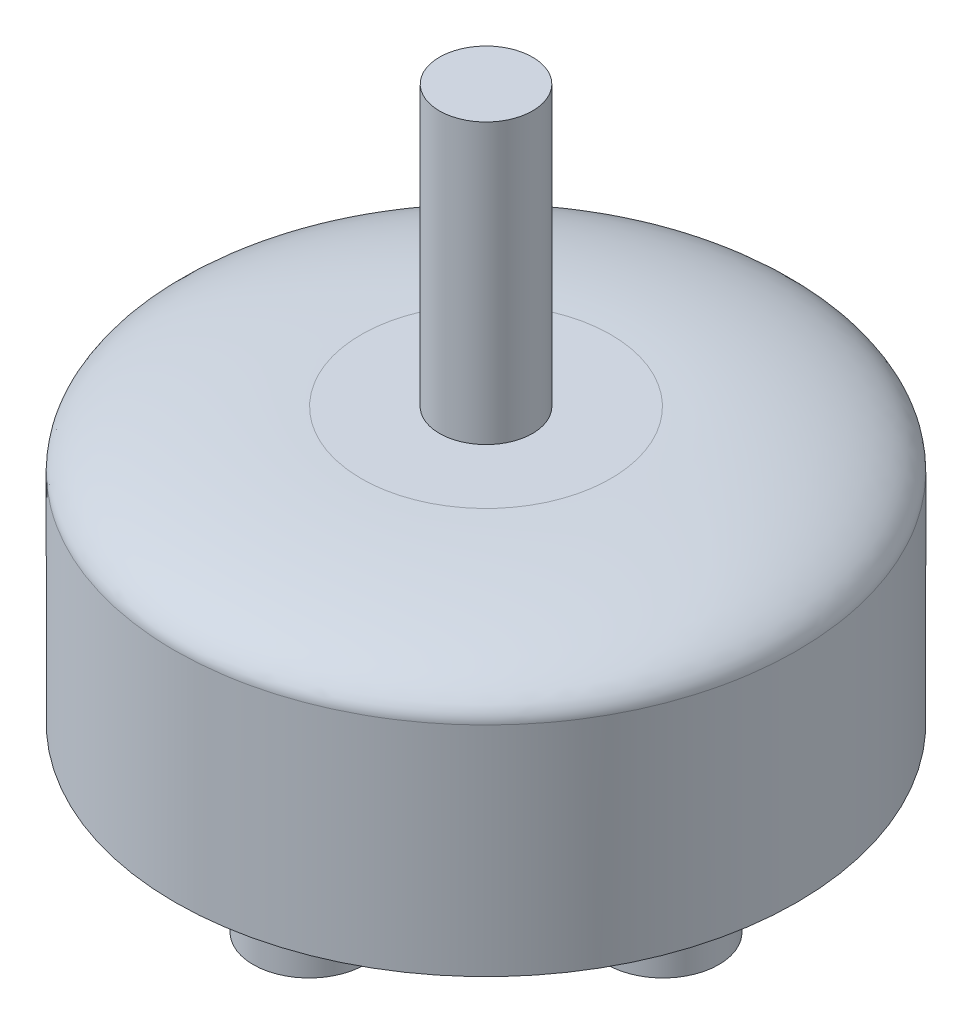
ISO-10303-21;
HEADER;
FILE_DESCRIPTION(('STEP AP214'),'2;1');
FILE_NAME('part.step','',(''),(''),'','','');
FILE_SCHEMA(('AUTOMOTIVE_DESIGN { 1 0 10303 214 1 1 1 1 }'));
ENDSEC;
DATA;
#1=APPLICATION_CONTEXT('core data for automotive mechanical design processes');
#2=APPLICATION_PROTOCOL_DEFINITION('international standard','automotive_design',2000,#1);
#3=PRODUCT_CONTEXT('',#1,'mechanical');
#4=PRODUCT('Part','Part','',(#3));
#5=PRODUCT_RELATED_PRODUCT_CATEGORY('part','',(#4));
#6=PRODUCT_DEFINITION_FORMATION('','',#4);
#7=PRODUCT_DEFINITION_CONTEXT('part definition',#1,'design');
#8=PRODUCT_DEFINITION('design','',#6,#7);
#9=PRODUCT_DEFINITION_SHAPE('','',#8);
#10=(LENGTH_UNIT() NAMED_UNIT(*) SI_UNIT(.MILLI.,.METRE.));
#11=(NAMED_UNIT(*) PLANE_ANGLE_UNIT() SI_UNIT($,.RADIAN.));
#12=(NAMED_UNIT(*) SI_UNIT($,.STERADIAN.) SOLID_ANGLE_UNIT());
#13=UNCERTAINTY_MEASURE_WITH_UNIT(LENGTH_MEASURE(1.E-05),#10,'distance_accuracy_value','');
#14=(GEOMETRIC_REPRESENTATION_CONTEXT(3) GLOBAL_UNCERTAINTY_ASSIGNED_CONTEXT((#13)) GLOBAL_UNIT_ASSIGNED_CONTEXT((#10,
#11,#12)) REPRESENTATION_CONTEXT('',''));
#15=CARTESIAN_POINT('',(0.,0.,0.));
#16=DIRECTION('',(0.,0.,1.));
#17=DIRECTION('',(1.,0.,0.));
#18=AXIS2_PLACEMENT_3D('',#15,#16,#17);
#19=CARTESIAN_POINT('',(-4.74999999999986,3.,1.34135758056431E-13));
#20=DIRECTION('',(0.,1.,0.));
#21=DIRECTION('',(0.,0.,1.));
#22=AXIS2_PLACEMENT_3D('',#19,#20,#21);
#23=PLANE('',#22);
#24=CARTESIAN_POINT('',(0.,3.,9.5));
#25=DIRECTION('',(0.,1.,0.));
#26=DIRECTION('',(0.,0.,1.));
#27=AXIS2_PLACEMENT_3D('',#24,#25,#26);
#28=CIRCLE('',#27,1.50000000000077);
#29=CARTESIAN_POINT('',(0.,3.,11.0000000000008));
#30=VERTEX_POINT('',#29);
#31=EDGE_CURVE('E263',#30,#30,#28,.T.);
#32=ORIENTED_EDGE('',*,*,#31,.F.);
#33=EDGE_LOOP('',(#32));
#34=FACE_BOUND('',#33,.T.);
#35=CARTESIAN_POINT('',(0.,3.,-9.5));
#36=DIRECTION('',(0.,1.,0.));
#37=DIRECTION('',(0.,0.,1.));
#38=AXIS2_PLACEMENT_3D('',#35,#36,#37);
#39=CIRCLE('',#38,1.5);
#40=CARTESIAN_POINT('',(0.,3.,-8.));
#41=VERTEX_POINT('',#40);
#42=EDGE_CURVE('E153',#41,#41,#39,.T.);
#43=ORIENTED_EDGE('',*,*,#42,.F.);
#44=EDGE_LOOP('',(#43));
#45=FACE_BOUND('',#44,.T.);
#46=CARTESIAN_POINT('',(0.,3.,0.));
#47=DIRECTION('',(0.,1.,0.));
#48=DIRECTION('',(0.,0.,1.));
#49=AXIS2_PLACEMENT_3D('',#46,#47,#48);
#50=CIRCLE('',#49,9.5);
#51=CARTESIAN_POINT('',(-2.96236784830953,3.,-9.02631578947369));
#52=VERTEX_POINT('',#51);
#53=CARTESIAN_POINT('',(-9.02631578947375,3.,-2.96236784830932));
#54=VERTEX_POINT('',#53);
#55=EDGE_CURVE('E164',#52,#54,#50,.T.);
#56=ORIENTED_EDGE('',*,*,#55,.T.);
#57=CARTESIAN_POINT('',(-9.49999999999973,3.,2.68271516112861E-13));
#58=DIRECTION('',(0.,1.,0.));
#59=DIRECTION('',(0.,0.,1.));
#60=AXIS2_PLACEMENT_3D('',#57,#58,#59);
#61=CIRCLE('',#60,3.);
#62=CARTESIAN_POINT('',(-9.02631578947359,3.,2.96236784830983));
#63=VERTEX_POINT('',#62);
#64=EDGE_CURVE('E112',#54,#63,#61,.T.);
#65=ORIENTED_EDGE('',*,*,#64,.T.);
#66=CARTESIAN_POINT('',(0.,3.,0.));
#67=DIRECTION('',(0.,1.,0.));
#68=DIRECTION('',(0.,0.,1.));
#69=AXIS2_PLACEMENT_3D('',#66,#67,#68);
#70=CIRCLE('',#69,9.5);
#71=CARTESIAN_POINT('',(-2.96236784830903,3.,9.02631578947385));
#72=VERTEX_POINT('',#71);
#73=EDGE_CURVE('E281',#63,#72,#70,.T.);
#74=ORIENTED_EDGE('',*,*,#73,.T.);
#75=CARTESIAN_POINT('',(5.37685650259296E-13,3.,9.5));
#76=DIRECTION('',(0.,1.,0.));
#77=DIRECTION('',(0.,0.,1.));
#78=AXIS2_PLACEMENT_3D('',#75,#76,#77);
#79=CIRCLE('',#78,3.);
#80=CARTESIAN_POINT('',(2.96236784831005,3.,9.02631578947351));
#81=VERTEX_POINT('',#80);
#82=EDGE_CURVE('E283',#72,#81,#79,.T.);
#83=ORIENTED_EDGE('',*,*,#82,.T.);
#84=CARTESIAN_POINT('',(0.,3.,0.));
#85=DIRECTION('',(0.,1.,0.));
#86=DIRECTION('',(0.,0.,1.));
#87=AXIS2_PLACEMENT_3D('',#84,#85,#86);
#88=CIRCLE('',#87,9.5);
#89=CARTESIAN_POINT('',(9.02631578947371,3.,2.96236784830944));
#90=VERTEX_POINT('',#89);
#91=EDGE_CURVE('E131',#81,#90,#88,.T.);
#92=ORIENTED_EDGE('',*,*,#91,.T.);
#93=CARTESIAN_POINT('',(9.50000000000026,3.,-2.70577548605625E-13));
#94=DIRECTION('',(0.,1.,0.));
#95=DIRECTION('',(0.,0.,1.));
#96=AXIS2_PLACEMENT_3D('',#93,#94,#95);
#97=CIRCLE('',#96,3.00000000000021);
#98=CARTESIAN_POINT('',(9.02631578947354,3.,-2.96236784830996));
#99=VERTEX_POINT('',#98);
#100=EDGE_CURVE('E125',#90,#99,#97,.T.);
#101=ORIENTED_EDGE('',*,*,#100,.T.);
#102=CARTESIAN_POINT('',(0.,3.,0.));
#103=DIRECTION('',(0.,1.,0.));
#104=DIRECTION('',(0.,0.,1.));
#105=AXIS2_PLACEMENT_3D('',#102,#103,#104);
#106=CIRCLE('',#105,9.5);
#107=CARTESIAN_POINT('',(2.96236784830953,3.,-9.02631578947368));
#108=VERTEX_POINT('',#107);
#109=EDGE_CURVE('E129',#99,#108,#106,.T.);
#110=ORIENTED_EDGE('',*,*,#109,.T.);
#111=CARTESIAN_POINT('',(0.,3.,-9.5));
#112=DIRECTION('',(0.,1.,0.));
#113=DIRECTION('',(0.,0.,1.));
#114=AXIS2_PLACEMENT_3D('',#111,#112,#113);
#115=CIRCLE('',#114,3.);
#116=EDGE_CURVE('E68',#108,#52,#115,.T.);
#117=ORIENTED_EDGE('',*,*,#116,.T.);
#118=EDGE_LOOP('',(#56,#65,#74,#83,#92,#101,#110,#117));
#119=FACE_BOUND('',#118,.T.);
#120=CARTESIAN_POINT('',(9.5,3.,0.));
#121=DIRECTION('',(0.,1.,0.));
#122=DIRECTION('',(0.,0.,1.));
#123=AXIS2_PLACEMENT_3D('',#120,#121,#122);
#124=CIRCLE('',#123,1.5000000000005);
#125=CARTESIAN_POINT('',(9.5,3.,1.5000000000005));
#126=VERTEX_POINT('',#125);
#127=EDGE_CURVE('E269',#126,#126,#124,.T.);
#128=ORIENTED_EDGE('',*,*,#127,.F.);
#129=EDGE_LOOP('',(#128));
#130=FACE_BOUND('',#129,.T.);
#131=CARTESIAN_POINT('',(-9.5,3.,0.));
#132=DIRECTION('',(0.,1.,0.));
#133=DIRECTION('',(0.,0.,1.));
#134=AXIS2_PLACEMENT_3D('',#131,#132,#133);
#135=CIRCLE('',#134,1.50000000000027);
#136=CARTESIAN_POINT('',(-9.5,3.,1.50000000000027));
#137=VERTEX_POINT('',#136);
#138=EDGE_CURVE('E257',#137,#137,#135,.T.);
#139=ORIENTED_EDGE('',*,*,#138,.F.);
#140=EDGE_LOOP('',(#139));
#141=FACE_BOUND('',#140,.T.);
#142=CARTESIAN_POINT('',(0.,3.,0.));
#143=DIRECTION('',(0.,1.,0.));
#144=DIRECTION('',(0.,0.,1.));
#145=AXIS2_PLACEMENT_3D('',#142,#143,#144);
#146=CIRCLE('',#145,7.);
#147=CARTESIAN_POINT('',(0.,3.,7.));
#148=VERTEX_POINT('',#147);
#149=EDGE_CURVE('E241',#148,#148,#146,.T.);
#150=ORIENTED_EDGE('',*,*,#149,.F.);
#151=EDGE_LOOP('',(#150));
#152=FACE_BOUND('',#151,.T.);
#153=ADVANCED_FACE('F45',(#34,#45,#119,#130,#141,#152),#23,.T.);
#154=CARTESIAN_POINT('',(-4.74999999999986,0.,1.34135758056431E-13));
#155=DIRECTION('',(0.,1.,0.));
#156=DIRECTION('',(0.,0.,1.));
#157=AXIS2_PLACEMENT_3D('',#154,#155,#156);
#158=PLANE('',#157);
#159=CARTESIAN_POINT('',(0.,0.,0.));
#160=DIRECTION('',(0.,1.,0.));
#161=DIRECTION('',(0.,0.,1.));
#162=AXIS2_PLACEMENT_3D('',#159,#160,#161);
#163=CIRCLE('',#162,9.5);
#164=CARTESIAN_POINT('',(-2.96236784830953,0.,-9.02631578947369));
#165=VERTEX_POINT('',#164);
#166=CARTESIAN_POINT('',(-9.02631578947375,0.,-2.96236784830932));
#167=VERTEX_POINT('',#166);
#168=EDGE_CURVE('E149',#165,#167,#163,.T.);
#169=ORIENTED_EDGE('',*,*,#168,.F.);
#170=CARTESIAN_POINT('',(0.,0.,-9.5));
#171=DIRECTION('',(0.,1.,0.));
#172=DIRECTION('',(0.,0.,1.));
#173=AXIS2_PLACEMENT_3D('',#170,#171,#172);
#174=CIRCLE('',#173,3.);
#175=CARTESIAN_POINT('',(2.96236784830953,0.,-9.02631578947368));
#176=VERTEX_POINT('',#175);
#177=EDGE_CURVE('E103',#176,#165,#174,.T.);
#178=ORIENTED_EDGE('',*,*,#177,.F.);
#179=CARTESIAN_POINT('',(0.,0.,0.));
#180=DIRECTION('',(0.,1.,0.));
#181=DIRECTION('',(0.,0.,1.));
#182=AXIS2_PLACEMENT_3D('',#179,#180,#181);
#183=CIRCLE('',#182,9.5);
#184=CARTESIAN_POINT('',(9.02631578947354,0.,-2.96236784830996));
#185=VERTEX_POINT('',#184);
#186=EDGE_CURVE('E97',#185,#176,#183,.T.);
#187=ORIENTED_EDGE('',*,*,#186,.F.);
#188=CARTESIAN_POINT('',(9.50000000000026,0.,-2.70577548605625E-13));
#189=DIRECTION('',(0.,1.,0.));
#190=DIRECTION('',(0.,0.,1.));
#191=AXIS2_PLACEMENT_3D('',#188,#189,#190);
#192=CIRCLE('',#191,3.00000000000021);
#193=CARTESIAN_POINT('',(9.02631578947371,0.,2.96236784830944));
#194=VERTEX_POINT('',#193);
#195=EDGE_CURVE('E139',#194,#185,#192,.T.);
#196=ORIENTED_EDGE('',*,*,#195,.F.);
#197=CARTESIAN_POINT('',(0.,0.,0.));
#198=DIRECTION('',(0.,1.,0.));
#199=DIRECTION('',(0.,0.,1.));
#200=AXIS2_PLACEMENT_3D('',#197,#198,#199);
#201=CIRCLE('',#200,9.5);
#202=CARTESIAN_POINT('',(2.96236784831005,0.,9.02631578947351));
#203=VERTEX_POINT('',#202);
#204=EDGE_CURVE('E159',#203,#194,#201,.T.);
#205=ORIENTED_EDGE('',*,*,#204,.F.);
#206=CARTESIAN_POINT('',(5.37685650259296E-13,0.,9.5));
#207=DIRECTION('',(0.,1.,0.));
#208=DIRECTION('',(0.,0.,1.));
#209=AXIS2_PLACEMENT_3D('',#206,#207,#208);
#210=CIRCLE('',#209,3.);
#211=CARTESIAN_POINT('',(-2.96236784830903,0.,9.02631578947385));
#212=VERTEX_POINT('',#211);
#213=EDGE_CURVE('E157',#212,#203,#210,.T.);
#214=ORIENTED_EDGE('',*,*,#213,.F.);
#215=CARTESIAN_POINT('',(0.,0.,0.));
#216=DIRECTION('',(0.,1.,0.));
#217=DIRECTION('',(0.,0.,1.));
#218=AXIS2_PLACEMENT_3D('',#215,#216,#217);
#219=CIRCLE('',#218,9.5);
#220=CARTESIAN_POINT('',(-9.02631578947359,0.,2.96236784830983));
#221=VERTEX_POINT('',#220);
#222=EDGE_CURVE('E155',#221,#212,#219,.T.);
#223=ORIENTED_EDGE('',*,*,#222,.F.);
#224=CARTESIAN_POINT('',(-9.49999999999973,0.,2.68271516112861E-13));
#225=DIRECTION('',(0.,1.,0.));
#226=DIRECTION('',(0.,0.,1.));
#227=AXIS2_PLACEMENT_3D('',#224,#225,#226);
#228=CIRCLE('',#227,3.);
#229=EDGE_CURVE('E152',#167,#221,#228,.T.);
#230=ORIENTED_EDGE('',*,*,#229,.F.);
#231=EDGE_LOOP('',(#169,#178,#187,#196,#205,#214,#223,#230));
#232=FACE_BOUND('',#231,.T.);
#233=CARTESIAN_POINT('',(0.,0.,-9.5));
#234=DIRECTION('',(0.,1.,0.));
#235=DIRECTION('',(0.,0.,1.));
#236=AXIS2_PLACEMENT_3D('',#233,#234,#235);
#237=CIRCLE('',#236,1.5);
#238=CARTESIAN_POINT('',(0.,0.,-8.));
#239=VERTEX_POINT('',#238);
#240=EDGE_CURVE('E272',#239,#239,#237,.T.);
#241=ORIENTED_EDGE('',*,*,#240,.T.);
#242=EDGE_LOOP('',(#241));
#243=FACE_BOUND('',#242,.T.);
#244=CARTESIAN_POINT('',(9.5,0.,0.));
#245=DIRECTION('',(0.,1.,0.));
#246=DIRECTION('',(0.,0.,1.));
#247=AXIS2_PLACEMENT_3D('',#244,#245,#246);
#248=CIRCLE('',#247,1.5000000000005);
#249=CARTESIAN_POINT('',(9.5,0.,1.5000000000005));
#250=VERTEX_POINT('',#249);
#251=EDGE_CURVE('E266',#250,#250,#248,.T.);
#252=ORIENTED_EDGE('',*,*,#251,.T.);
#253=EDGE_LOOP('',(#252));
#254=FACE_BOUND('',#253,.T.);
#255=CARTESIAN_POINT('',(0.,0.,9.5));
#256=DIRECTION('',(0.,1.,0.));
#257=DIRECTION('',(0.,0.,1.));
#258=AXIS2_PLACEMENT_3D('',#255,#256,#257);
#259=CIRCLE('',#258,1.50000000000077);
#260=CARTESIAN_POINT('',(0.,0.,11.0000000000008));
#261=VERTEX_POINT('',#260);
#262=EDGE_CURVE('E260',#261,#261,#259,.T.);
#263=ORIENTED_EDGE('',*,*,#262,.T.);
#264=EDGE_LOOP('',(#263));
#265=FACE_BOUND('',#264,.T.);
#266=CARTESIAN_POINT('',(-9.5,0.,0.));
#267=DIRECTION('',(0.,1.,0.));
#268=DIRECTION('',(0.,0.,1.));
#269=AXIS2_PLACEMENT_3D('',#266,#267,#268);
#270=CIRCLE('',#269,1.50000000000027);
#271=CARTESIAN_POINT('',(-9.5,0.,1.50000000000027));
#272=VERTEX_POINT('',#271);
#273=EDGE_CURVE('E256',#272,#272,#270,.T.);
#274=ORIENTED_EDGE('',*,*,#273,.T.);
#275=EDGE_LOOP('',(#274));
#276=FACE_BOUND('',#275,.T.);
#277=CARTESIAN_POINT('',(0.,0.,0.));
#278=DIRECTION('',(0.,1.,0.));
#279=DIRECTION('',(0.,0.,1.));
#280=AXIS2_PLACEMENT_3D('',#277,#278,#279);
#281=CIRCLE('',#280,4.5);
#282=CARTESIAN_POINT('',(0.,0.,4.5));
#283=VERTEX_POINT('',#282);
#284=EDGE_CURVE('E251',#283,#283,#281,.T.);
#285=ORIENTED_EDGE('',*,*,#284,.T.);
#286=EDGE_LOOP('',(#285));
#287=FACE_BOUND('',#286,.T.);
#288=ADVANCED_FACE('F296',(#232,#243,#254,#265,#276,#287),#158,.F.);
#289=CARTESIAN_POINT('',(0.,3.,0.));
#290=DIRECTION('',(0.,-1.,0.));
#291=DIRECTION('',(0.,0.,-1.));
#292=AXIS2_PLACEMENT_3D('',#289,#290,#291);
#293=CYLINDRICAL_SURFACE('',#292,9.5);
#294=ORIENTED_EDGE('',*,*,#168,.T.);
#295=DIRECTION('',(0.,-1.,0.));
#296=VECTOR('',#295,1.);
#297=CARTESIAN_POINT('',(-9.02631578947375,3.,-2.96236784830932));
#298=LINE('',#297,#296);
#299=EDGE_CURVE('E177',#54,#167,#298,.T.);
#300=ORIENTED_EDGE('',*,*,#299,.F.);
#301=ORIENTED_EDGE('',*,*,#55,.F.);
#302=DIRECTION('',(0.,-1.,0.));
#303=VECTOR('',#302,1.);
#304=CARTESIAN_POINT('',(-2.96236784830953,3.,-9.02631578947369));
#305=LINE('',#304,#303);
#306=EDGE_CURVE('E145',#52,#165,#305,.T.);
#307=ORIENTED_EDGE('',*,*,#306,.T.);
#308=EDGE_LOOP('',(#294,#300,#301,#307));
#309=FACE_BOUND('',#308,.T.);
#310=ADVANCED_FACE('F301',(#309),#293,.T.);
#311=CARTESIAN_POINT('',(-9.49999999999973,3.,2.68271516112861E-13));
#312=DIRECTION('',(0.,-1.,0.));
#313=DIRECTION('',(0.,0.,-1.));
#314=AXIS2_PLACEMENT_3D('',#311,#312,#313);
#315=CYLINDRICAL_SURFACE('',#314,3.);
#316=ORIENTED_EDGE('',*,*,#229,.T.);
#317=DIRECTION('',(0.,-1.,0.));
#318=VECTOR('',#317,1.);
#319=CARTESIAN_POINT('',(-9.02631578947359,3.,2.96236784830983));
#320=LINE('',#319,#318);
#321=EDGE_CURVE('E174',#63,#221,#320,.T.);
#322=ORIENTED_EDGE('',*,*,#321,.F.);
#323=ORIENTED_EDGE('',*,*,#64,.F.);
#324=ORIENTED_EDGE('',*,*,#299,.T.);
#325=EDGE_LOOP('',(#316,#322,#323,#324));
#326=FACE_BOUND('',#325,.T.);
#327=ADVANCED_FACE('F402',(#326),#315,.T.);
#328=CARTESIAN_POINT('',(0.,3.,0.));
#329=DIRECTION('',(0.,-1.,0.));
#330=DIRECTION('',(0.,0.,-1.));
#331=AXIS2_PLACEMENT_3D('',#328,#329,#330);
#332=CYLINDRICAL_SURFACE('',#331,9.5);
#333=ORIENTED_EDGE('',*,*,#222,.T.);
#334=DIRECTION('',(0.,-1.,0.));
#335=VECTOR('',#334,1.);
#336=CARTESIAN_POINT('',(-2.96236784830903,3.,9.02631578947385));
#337=LINE('',#336,#335);
#338=EDGE_CURVE('E171',#72,#212,#337,.T.);
#339=ORIENTED_EDGE('',*,*,#338,.F.);
#340=ORIENTED_EDGE('',*,*,#73,.F.);
#341=ORIENTED_EDGE('',*,*,#321,.T.);
#342=EDGE_LOOP('',(#333,#339,#340,#341));
#343=FACE_BOUND('',#342,.T.);
#344=ADVANCED_FACE('F410',(#343),#332,.T.);
#345=CARTESIAN_POINT('',(5.37685650259296E-13,3.,9.5));
#346=DIRECTION('',(0.,-1.,0.));
#347=DIRECTION('',(0.,0.,-1.));
#348=AXIS2_PLACEMENT_3D('',#345,#346,#347);
#349=CYLINDRICAL_SURFACE('',#348,3.);
#350=ORIENTED_EDGE('',*,*,#213,.T.);
#351=DIRECTION('',(0.,-1.,0.));
#352=VECTOR('',#351,1.);
#353=CARTESIAN_POINT('',(2.96236784831005,3.,9.02631578947351));
#354=LINE('',#353,#352);
#355=EDGE_CURVE('E168',#81,#203,#354,.T.);
#356=ORIENTED_EDGE('',*,*,#355,.F.);
#357=ORIENTED_EDGE('',*,*,#82,.F.);
#358=ORIENTED_EDGE('',*,*,#338,.T.);
#359=EDGE_LOOP('',(#350,#356,#357,#358));
#360=FACE_BOUND('',#359,.T.);
#361=ADVANCED_FACE('F289',(#360),#349,.T.);
#362=CARTESIAN_POINT('',(0.,3.,0.));
#363=DIRECTION('',(0.,-1.,0.));
#364=DIRECTION('',(0.,0.,-1.));
#365=AXIS2_PLACEMENT_3D('',#362,#363,#364);
#366=CYLINDRICAL_SURFACE('',#365,9.5);
#367=ORIENTED_EDGE('',*,*,#204,.T.);
#368=DIRECTION('',(0.,-1.,0.));
#369=VECTOR('',#368,1.);
#370=CARTESIAN_POINT('',(9.02631578947371,3.,2.96236784830944));
#371=LINE('',#370,#369);
#372=EDGE_CURVE('E140',#90,#194,#371,.T.);
#373=ORIENTED_EDGE('',*,*,#372,.F.);
#374=ORIENTED_EDGE('',*,*,#91,.F.);
#375=ORIENTED_EDGE('',*,*,#355,.T.);
#376=EDGE_LOOP('',(#367,#373,#374,#375));
#377=FACE_BOUND('',#376,.T.);
#378=ADVANCED_FACE('F293',(#377),#366,.T.);
#379=CARTESIAN_POINT('',(9.50000000000026,3.,-2.70577548605625E-13));
#380=DIRECTION('',(0.,-1.,0.));
#381=DIRECTION('',(0.,0.,-1.));
#382=AXIS2_PLACEMENT_3D('',#379,#380,#381);
#383=CYLINDRICAL_SURFACE('',#382,3.00000000000021);
#384=ORIENTED_EDGE('',*,*,#195,.T.);
#385=DIRECTION('',(0.,-1.,0.));
#386=VECTOR('',#385,1.);
#387=CARTESIAN_POINT('',(9.02631578947354,3.,-2.96236784830996));
#388=LINE('',#387,#386);
#389=EDGE_CURVE('E136',#99,#185,#388,.T.);
#390=ORIENTED_EDGE('',*,*,#389,.F.);
#391=ORIENTED_EDGE('',*,*,#100,.F.);
#392=ORIENTED_EDGE('',*,*,#372,.T.);
#393=EDGE_LOOP('',(#384,#390,#391,#392));
#394=FACE_BOUND('',#393,.T.);
#395=ADVANCED_FACE('F137',(#394),#383,.T.);
#396=CARTESIAN_POINT('',(0.,3.,0.));
#397=DIRECTION('',(0.,-1.,0.));
#398=DIRECTION('',(0.,0.,-1.));
#399=AXIS2_PLACEMENT_3D('',#396,#397,#398);
#400=CYLINDRICAL_SURFACE('',#399,9.5);
#401=ORIENTED_EDGE('',*,*,#186,.T.);
#402=DIRECTION('',(0.,-1.,0.));
#403=VECTOR('',#402,1.);
#404=CARTESIAN_POINT('',(2.96236784830953,3.,-9.02631578947368));
#405=LINE('',#404,#403);
#406=EDGE_CURVE('E141',#108,#176,#405,.T.);
#407=ORIENTED_EDGE('',*,*,#406,.F.);
#408=ORIENTED_EDGE('',*,*,#109,.F.);
#409=ORIENTED_EDGE('',*,*,#389,.T.);
#410=EDGE_LOOP('',(#401,#407,#408,#409));
#411=FACE_BOUND('',#410,.T.);
#412=ADVANCED_FACE('F143',(#411),#400,.T.);
#413=CARTESIAN_POINT('',(0.,3.,-9.5));
#414=DIRECTION('',(0.,-1.,0.));
#415=DIRECTION('',(0.,0.,-1.));
#416=AXIS2_PLACEMENT_3D('',#413,#414,#415);
#417=CYLINDRICAL_SURFACE('',#416,3.);
#418=ORIENTED_EDGE('',*,*,#177,.T.);
#419=ORIENTED_EDGE('',*,*,#306,.F.);
#420=ORIENTED_EDGE('',*,*,#116,.F.);
#421=ORIENTED_EDGE('',*,*,#406,.T.);
#422=EDGE_LOOP('',(#418,#419,#420,#421));
#423=FACE_BOUND('',#422,.T.);
#424=ADVANCED_FACE('F303',(#423),#417,.T.);
#425=CARTESIAN_POINT('',(0.,3.,-9.5));
#426=DIRECTION('',(0.,-1.,0.));
#427=DIRECTION('',(0.,0.,-1.));
#428=AXIS2_PLACEMENT_3D('',#425,#426,#427);
#429=CYLINDRICAL_SURFACE('',#428,1.5);
#430=ORIENTED_EDGE('',*,*,#42,.T.);
#431=EDGE_LOOP('',(#430));
#432=FACE_BOUND('',#431,.T.);
#433=ORIENTED_EDGE('',*,*,#240,.F.);
#434=EDGE_LOOP('',(#433));
#435=FACE_BOUND('',#434,.T.);
#436=ADVANCED_FACE('F305',(#432,#435),#429,.F.);
#437=CARTESIAN_POINT('',(9.5,3.,0.));
#438=DIRECTION('',(0.,-1.,0.));
#439=DIRECTION('',(0.,0.,-1.));
#440=AXIS2_PLACEMENT_3D('',#437,#438,#439);
#441=CYLINDRICAL_SURFACE('',#440,1.5000000000005);
#442=ORIENTED_EDGE('',*,*,#127,.T.);
#443=EDGE_LOOP('',(#442));
#444=FACE_BOUND('',#443,.T.);
#445=ORIENTED_EDGE('',*,*,#251,.F.);
#446=EDGE_LOOP('',(#445));
#447=FACE_BOUND('',#446,.T.);
#448=ADVANCED_FACE('F311',(#444,#447),#441,.F.);
#449=CARTESIAN_POINT('',(0.,3.,9.5));
#450=DIRECTION('',(0.,-1.,0.));
#451=DIRECTION('',(0.,0.,-1.));
#452=AXIS2_PLACEMENT_3D('',#449,#450,#451);
#453=CYLINDRICAL_SURFACE('',#452,1.50000000000077);
#454=ORIENTED_EDGE('',*,*,#31,.T.);
#455=EDGE_LOOP('',(#454));
#456=FACE_BOUND('',#455,.T.);
#457=ORIENTED_EDGE('',*,*,#262,.F.);
#458=EDGE_LOOP('',(#457));
#459=FACE_BOUND('',#458,.T.);
#460=ADVANCED_FACE('F327',(#456,#459),#453,.F.);
#461=CARTESIAN_POINT('',(-9.5,3.,0.));
#462=DIRECTION('',(0.,-1.,0.));
#463=DIRECTION('',(0.,0.,-1.));
#464=AXIS2_PLACEMENT_3D('',#461,#462,#463);
#465=CYLINDRICAL_SURFACE('',#464,1.50000000000027);
#466=ORIENTED_EDGE('',*,*,#138,.T.);
#467=EDGE_LOOP('',(#466));
#468=FACE_BOUND('',#467,.T.);
#469=ORIENTED_EDGE('',*,*,#273,.F.);
#470=EDGE_LOOP('',(#469));
#471=FACE_BOUND('',#470,.T.);
#472=ADVANCED_FACE('F331',(#468,#471),#465,.F.);
#473=CARTESIAN_POINT('',(0.,3.,0.));
#474=DIRECTION('',(0.,-1.,0.));
#475=DIRECTION('',(0.,0.,-1.));
#476=AXIS2_PLACEMENT_3D('',#473,#474,#475);
#477=CYLINDRICAL_SURFACE('',#476,4.5);
#478=ORIENTED_EDGE('',*,*,#284,.F.);
#479=EDGE_LOOP('',(#478));
#480=FACE_BOUND('',#479,.T.);
#481=CARTESIAN_POINT('',(0.,5.,0.));
#482=DIRECTION('',(0.,1.,0.));
#483=DIRECTION('',(0.,0.,1.));
#484=AXIS2_PLACEMENT_3D('',#481,#482,#483);
#485=CIRCLE('',#484,4.5);
#486=CARTESIAN_POINT('',(0.,5.,4.5));
#487=VERTEX_POINT('',#486);
#488=EDGE_CURVE('E237',#487,#487,#485,.T.);
#489=ORIENTED_EDGE('',*,*,#488,.T.);
#490=EDGE_LOOP('',(#489));
#491=FACE_BOUND('',#490,.T.);
#492=ADVANCED_FACE('F334',(#480,#491),#477,.F.);
#493=CARTESIAN_POINT('',(0.,5.,0.));
#494=DIRECTION('',(0.,-1.,0.));
#495=DIRECTION('',(0.,0.,-1.));
#496=AXIS2_PLACEMENT_3D('',#493,#494,#495);
#497=CYLINDRICAL_SURFACE('',#496,7.);
#498=CARTESIAN_POINT('',(0.,5.,0.));
#499=DIRECTION('',(0.,1.,0.));
#500=DIRECTION('',(0.,0.,1.));
#501=AXIS2_PLACEMENT_3D('',#498,#499,#500);
#502=CIRCLE('',#501,7.);
#503=CARTESIAN_POINT('',(0.,5.,7.));
#504=VERTEX_POINT('',#503);
#505=EDGE_CURVE('E248',#504,#504,#502,.T.);
#506=ORIENTED_EDGE('',*,*,#505,.F.);
#507=EDGE_LOOP('',(#506));
#508=FACE_BOUND('',#507,.T.);
#509=ORIENTED_EDGE('',*,*,#149,.T.);
#510=EDGE_LOOP('',(#509));
#511=FACE_BOUND('',#510,.T.);
#512=ADVANCED_FACE('F211',(#508,#511),#497,.T.);
#513=CARTESIAN_POINT('',(0.,5.,0.));
#514=DIRECTION('',(0.,1.,0.));
#515=DIRECTION('',(0.,0.,1.));
#516=AXIS2_PLACEMENT_3D('',#513,#514,#515);
#517=PLANE('',#516);
#518=ORIENTED_EDGE('',*,*,#488,.F.);
#519=EDGE_LOOP('',(#518));
#520=FACE_BOUND('',#519,.T.);
#521=ADVANCED_FACE('F206',(#520),#517,.F.);
#522=CARTESIAN_POINT('',(0.,19.7,0.));
#523=DIRECTION('',(0.,-1.,0.));
#524=DIRECTION('',(0.,0.,-1.));
#525=AXIS2_PLACEMENT_3D('',#522,#523,#524);
#526=CYLINDRICAL_SURFACE('',#525,16.7);
#527=CARTESIAN_POINT('',(0.,16.7,16.7));
#528=CARTESIAN_POINT('',(2.1860248800064,16.7,16.7));
#529=CARTESIAN_POINT('',(4.37118967629864,16.7,16.2653436972548));
#530=CARTESIAN_POINT('',(8.41043696469535,16.7,14.5922326886222));
#531=CARTESIAN_POINT('',(10.262930229321,16.7,13.3544362623097));
#532=CARTESIAN_POINT('',(13.3544362623097,16.7,10.262930229321));
#533=CARTESIAN_POINT('',(14.592232688622,16.7,8.41043696469572));
#534=CARTESIAN_POINT('',(16.265343697255,16.7,4.37118967629827));
#535=CARTESIAN_POINT('',(16.7,16.7,2.18602488000667));
#536=CARTESIAN_POINT('',(16.7,16.7,-2.18602488000667));
#537=CARTESIAN_POINT('',(16.2653436972551,16.7,-4.37118967629796));
#538=CARTESIAN_POINT('',(14.5922326886219,16.7,-8.41043696469606));
#539=CARTESIAN_POINT('',(13.3544362623116,16.7,-10.2629302293191));
#540=CARTESIAN_POINT('',(10.2629302293191,16.7,-13.3544362623116));
#541=CARTESIAN_POINT('',(8.41043696469588,16.7,-14.5922326886219));
#542=CARTESIAN_POINT('',(4.37118967629817,16.7,-16.265343697255));
#543=CARTESIAN_POINT('',(2.18602488000667,16.7,-16.7));
#544=CARTESIAN_POINT('',(-2.18602488000667,16.7,-16.7));
#545=CARTESIAN_POINT('',(-4.37118967629839,16.7,-16.2653436972549));
#546=CARTESIAN_POINT('',(-8.41043696469557,16.7,-14.5922326886221));
#547=CARTESIAN_POINT('',(-10.2629302293199,16.7,-13.3544362623108));
#548=CARTESIAN_POINT('',(-13.3544362623108,16.7,-10.2629302293199));
#549=CARTESIAN_POINT('',(-14.5922326886219,16.7,-8.41043696469594));
#550=CARTESIAN_POINT('',(-16.2653436972551,16.7,-4.3711896762981));
#551=CARTESIAN_POINT('',(-16.7,16.7,-2.18602488000665));
#552=CARTESIAN_POINT('',(-16.7,16.7,2.1860248800067));
#553=CARTESIAN_POINT('',(-16.2653436972549,16.7,4.37118967629832));
#554=CARTESIAN_POINT('',(-14.592232688622,16.7,8.41043696469563));
#555=CARTESIAN_POINT('',(-13.3544362623101,16.7,10.2629302293206));
#556=CARTESIAN_POINT('',(-10.2629302293206,16.7,13.35443626231));
#557=CARTESIAN_POINT('',(-8.41043696469545,16.7,14.5922326886221));
#558=CARTESIAN_POINT('',(-4.37118967629859,16.7,16.2653436972548));
#559=CARTESIAN_POINT('',(-2.1860248800064,16.7,16.7));
#560=CARTESIAN_POINT('',(0.,16.7,16.7));
#561=(BOUNDED_CURVE() B_SPLINE_CURVE(3,(#527,#528,#529,#530,#531,#532,#533,#534,#535,#536,#537,
#538,#539,#540,#541,#542,#543,#544,#545,#546,#547,#548,#549,#550,#551,#552,#553,#554,#555,#556,
#557,#558,#559,#560),.UNSPECIFIED.,.T.,.F.) B_SPLINE_CURVE_WITH_KNOTS((4,2,2,2,2,2,2,2,2,2,2,2,
2,2,2,2,4),(0.,0.392699081698724,0.785398163397448,1.17809724509617,1.5707963267949,
1.96349540849362,2.35619449019234,2.74889357189107,3.14159265358979,3.53429173528852,
3.92699081698724,4.31968989868597,4.71238898038469,5.10508806208341,5.49778714378214,
5.89048622548086,6.28318530717959),
.UNSPECIFIED.) CURVE() GEOMETRIC_REPRESENTATION_ITEM() RATIONAL_B_SPLINE_CURVE((1.,1.,1.,1.,1.,
1.,1.,1.,1.,1.,1.,1.,1.,1.,1.,1.,1.,1.,1.,1.,1.,1.,1.,1.,1.,1.,1.,1.,1.,1.,1.,1.,1.,1.)) REPRESENTATION_ITEM(''));
#562=CARTESIAN_POINT('',(0.,16.7,16.7));
#563=VERTEX_POINT('',#562);
#564=EDGE_CURVE('E12',#563,#563,#561,.F.);
#565=ORIENTED_EDGE('',*,*,#564,.T.);
#566=EDGE_LOOP('',(#565));
#567=FACE_BOUND('',#566,.T.);
#568=CARTESIAN_POINT('',(0.,5.,0.));
#569=DIRECTION('',(0.,1.,0.));
#570=DIRECTION('',(0.,0.,1.));
#571=AXIS2_PLACEMENT_3D('',#568,#569,#570);
#572=CIRCLE('',#571,16.7);
#573=CARTESIAN_POINT('',(0.,5.,16.7));
#574=VERTEX_POINT('',#573);
#575=EDGE_CURVE('E235',#574,#574,#572,.T.);
#576=ORIENTED_EDGE('',*,*,#575,.T.);
#577=EDGE_LOOP('',(#576));
#578=FACE_BOUND('',#577,.T.);
#579=ADVANCED_FACE('F199',(#567,#578),#526,.T.);
#580=CARTESIAN_POINT('',(0.,19.7,0.));
#581=DIRECTION('',(0.,1.,0.));
#582=DIRECTION('',(0.,0.,1.));
#583=AXIS2_PLACEMENT_3D('',#580,#581,#582);
#584=PLANE('',#583);
#585=CARTESIAN_POINT('',(0.,19.7,0.));
#586=DIRECTION('',(0.,1.,0.));
#587=DIRECTION('',(0.,0.,1.));
#588=AXIS2_PLACEMENT_3D('',#585,#586,#587);
#589=CIRCLE('',#588,2.5);
#590=CARTESIAN_POINT('',(0.,19.7,2.5));
#591=VERTEX_POINT('',#590);
#592=EDGE_CURVE('E244',#591,#591,#589,.T.);
#593=ORIENTED_EDGE('',*,*,#592,.F.);
#594=EDGE_LOOP('',(#593));
#595=FACE_BOUND('',#594,.T.);
#596=CARTESIAN_POINT('',(0.,19.7,6.7));
#597=CARTESIAN_POINT('',(-0.877027945870833,19.7,6.7));
#598=CARTESIAN_POINT('',(-1.75371082821547,19.7,6.5256169324312));
#599=CARTESIAN_POINT('',(-3.37424716547675,19.7,5.85436880322004));
#600=CARTESIAN_POINT('',(-4.1174630261344,19.7,5.35776784176495));
#601=CARTESIAN_POINT('',(-5.35776784176536,19.7,4.11746302613475));
#602=CARTESIAN_POINT('',(-5.85436880321967,19.7,3.37424716547673));
#603=CARTESIAN_POINT('',(-6.52561693243158,19.7,1.75371082821545));
#604=CARTESIAN_POINT('',(-6.7,19.7,0.877027945870951));
#605=CARTESIAN_POINT('',(-6.7,19.7,-0.877027945870929));
#606=CARTESIAN_POINT('',(-6.52561693243158,19.7,-1.75371082821547));
#607=CARTESIAN_POINT('',(-5.85436880321966,19.7,-3.37424716547675));
#608=CARTESIAN_POINT('',(-5.35776784176541,19.7,-4.11746302613433));
#609=CARTESIAN_POINT('',(-4.11746302613434,19.7,-5.3577678417654));
#610=CARTESIAN_POINT('',(-3.3742471654766,19.7,-5.85436880321952));
#611=CARTESIAN_POINT('',(-1.75371082821558,19.7,-6.52561693243173));
#612=CARTESIAN_POINT('',(-0.877027945870938,19.7,-6.7));
#613=CARTESIAN_POINT('',(0.87702794587094,19.7,-6.7));
#614=CARTESIAN_POINT('',(1.75371082821541,19.7,-6.52561693243134));
#615=CARTESIAN_POINT('',(3.37424716547681,19.7,-5.8543688032199));
#616=CARTESIAN_POINT('',(4.11746302613433,19.7,-5.35776784176579));
#617=CARTESIAN_POINT('',(5.3577678417654,19.7,-4.11746302613396));
#618=CARTESIAN_POINT('',(5.8543688032194,19.7,-3.37424716547668));
#619=CARTESIAN_POINT('',(6.52561693243184,19.7,-1.75371082821553));
#620=CARTESIAN_POINT('',(6.7,19.7,-0.877027945870939));
#621=CARTESIAN_POINT('',(6.7,19.7,0.87702794587094));
#622=CARTESIAN_POINT('',(6.52561693243146,19.7,1.75371082821552));
#623=CARTESIAN_POINT('',(5.85436880321978,19.7,3.37424716547668));
#624=CARTESIAN_POINT('',(5.3577678417651,19.7,4.11746302613463));
#625=CARTESIAN_POINT('',(4.11746302613463,19.7,5.3577678417651));
#626=CARTESIAN_POINT('',(3.37424716547676,19.7,5.8543688032199));
#627=CARTESIAN_POINT('',(1.75371082821545,19.7,6.52561693243134));
#628=CARTESIAN_POINT('',(0.877027945870832,19.7,6.7));
#629=CARTESIAN_POINT('',(0.,19.7,6.7));
#630=(BOUNDED_CURVE() B_SPLINE_CURVE(3,(#596,#597,#598,#599,#600,#601,#602,#603,#604,#605,#606,
#607,#608,#609,#610,#611,#612,#613,#614,#615,#616,#617,#618,#619,#620,#621,#622,#623,#624,#625,
#626,#627,#628,#629),.UNSPECIFIED.,.T.,.F.) B_SPLINE_CURVE_WITH_KNOTS((4,2,2,2,2,2,2,2,2,2,2,2,
2,2,2,2,4),(0.,0.392699081698725,0.785398163397448,1.17809724509617,1.5707963267949,
1.96349540849362,2.35619449019234,2.74889357189107,3.14159265358979,3.53429173528852,
3.92699081698724,4.31968989868597,4.71238898038469,5.10508806208341,5.49778714378214,
5.89048622548086,6.28318530717959),
.UNSPECIFIED.) CURVE() GEOMETRIC_REPRESENTATION_ITEM() RATIONAL_B_SPLINE_CURVE((1.,1.,1.,1.,1.,
1.,1.,1.,1.,1.,1.,1.,1.,1.,1.,1.,1.,1.,1.,1.,1.,1.,1.,1.,1.,1.,1.,1.,1.,1.,1.,1.,1.,1.)) REPRESENTATION_ITEM(''));
#631=CARTESIAN_POINT('',(0.,19.7,6.7));
#632=VERTEX_POINT('',#631);
#633=EDGE_CURVE('E60',#632,#632,#630,.F.);
#634=ORIENTED_EDGE('',*,*,#633,.T.);
#635=EDGE_LOOP('',(#634));
#636=FACE_BOUND('',#635,.T.);
#637=ADVANCED_FACE('F188',(#595,#636),#584,.T.);
#638=ORIENTED_EDGE('',*,*,#505,.T.);
#639=EDGE_LOOP('',(#638));
#640=FACE_BOUND('',#639,.T.);
#641=ORIENTED_EDGE('',*,*,#575,.F.);
#642=EDGE_LOOP('',(#641));
#643=FACE_BOUND('',#642,.T.);
#644=ADVANCED_FACE('F198',(#640,#643),#517,.F.);
#645=CARTESIAN_POINT('',(0.,19.7,6.7));
#646=CARTESIAN_POINT('',(0.877027945870832,19.7,6.7));
#647=CARTESIAN_POINT('',(1.75371082821545,19.7,6.52561693243134));
#648=CARTESIAN_POINT('',(3.37424716547676,19.7,5.8543688032199));
#649=CARTESIAN_POINT('',(4.11746302613463,19.7,5.3577678417651));
#650=CARTESIAN_POINT('',(5.3577678417651,19.7,4.11746302613463));
#651=CARTESIAN_POINT('',(5.85436880321978,19.7,3.37424716547668));
#652=CARTESIAN_POINT('',(6.52561693243146,19.7,1.75371082821552));
#653=CARTESIAN_POINT('',(6.7,19.7,0.87702794587094));
#654=CARTESIAN_POINT('',(6.7,19.7,-0.877027945870939));
#655=CARTESIAN_POINT('',(6.52561693243184,19.7,-1.75371082821553));
#656=CARTESIAN_POINT('',(5.8543688032194,19.7,-3.37424716547668));
#657=CARTESIAN_POINT('',(5.3577678417654,19.7,-4.11746302613396));
#658=CARTESIAN_POINT('',(4.11746302613433,19.7,-5.35776784176579));
#659=CARTESIAN_POINT('',(3.37424716547681,19.7,-5.8543688032199));
#660=CARTESIAN_POINT('',(1.75371082821541,19.7,-6.52561693243134));
#661=CARTESIAN_POINT('',(0.87702794587094,19.7,-6.7));
#662=CARTESIAN_POINT('',(-0.877027945870938,19.7,-6.7));
#663=CARTESIAN_POINT('',(-1.75371082821558,19.7,-6.52561693243173));
#664=CARTESIAN_POINT('',(-3.3742471654766,19.7,-5.85436880321952));
#665=CARTESIAN_POINT('',(-4.11746302613434,19.7,-5.3577678417654));
#666=CARTESIAN_POINT('',(-5.35776784176541,19.7,-4.11746302613433));
#667=CARTESIAN_POINT('',(-5.85436880321966,19.7,-3.37424716547675));
#668=CARTESIAN_POINT('',(-6.52561693243158,19.7,-1.75371082821547));
#669=CARTESIAN_POINT('',(-6.7,19.7,-0.877027945870929));
#670=CARTESIAN_POINT('',(-6.7,19.7,0.877027945870951));
#671=CARTESIAN_POINT('',(-6.52561693243158,19.7,1.75371082821545));
#672=CARTESIAN_POINT('',(-5.85436880321967,19.7,3.37424716547673));
#673=CARTESIAN_POINT('',(-5.35776784176536,19.7,4.11746302613475));
#674=CARTESIAN_POINT('',(-4.1174630261344,19.7,5.35776784176495));
#675=CARTESIAN_POINT('',(-3.37424716547675,19.7,5.85436880322004));
#676=CARTESIAN_POINT('',(-1.75371082821547,19.7,6.5256169324312));
#677=CARTESIAN_POINT('',(-0.877027945870833,19.7,6.7));
#678=CARTESIAN_POINT('',(0.,19.7,6.7));
#679=CARTESIAN_POINT('',(0.,19.7,16.7));
#680=CARTESIAN_POINT('',(2.1860248800064,19.7000000000015,16.7000000000015));
#681=CARTESIAN_POINT('',(4.37118967629815,19.7,16.2653436972536));
#682=CARTESIAN_POINT('',(8.41043696469584,19.7,14.5922326886233));
#683=CARTESIAN_POINT('',(10.262930229321,19.7,13.3544362623097));
#684=CARTESIAN_POINT('',(13.3544362623097,19.7,10.262930229321));
#685=CARTESIAN_POINT('',(14.5922326886223,19.7,8.41043696469583));
#686=CARTESIAN_POINT('',(16.2653436972547,19.7,4.37118967629816));
#687=CARTESIAN_POINT('',(16.7,19.7,2.18602488000667));
#688=CARTESIAN_POINT('',(16.7,19.7,-2.18602488000667));
#689=CARTESIAN_POINT('',(16.2653436972547,19.7000000000015,-4.37118967629779));
#690=CARTESIAN_POINT('',(14.5922326886223,19.6999999999985,-8.41043696469622));
#691=CARTESIAN_POINT('',(13.3544362623116,19.7,-10.2629302293191));
#692=CARTESIAN_POINT('',(10.2629302293191,19.7,-13.3544362623116));
#693=CARTESIAN_POINT('',(8.4104369646959,19.6999999999985,-14.5922326886235));
#694=CARTESIAN_POINT('',(4.37118967629815,19.7000000000015,-16.2653436972535));
#695=CARTESIAN_POINT('',(2.18602488000667,19.7,-16.7));
#696=CARTESIAN_POINT('',(-2.18602488000667,19.7,-16.7));
#697=CARTESIAN_POINT('',(-4.37118967629772,19.7000000000015,-16.2653436972535));
#698=CARTESIAN_POINT('',(-8.41043696469623,19.6999999999985,-14.5922326886235));
#699=CARTESIAN_POINT('',(-10.2629302293207,19.7,-13.3544362623116));
#700=CARTESIAN_POINT('',(-13.35443626231,19.7,-10.2629302293191));
#701=CARTESIAN_POINT('',(-14.5922326886225,19.7000000000015,-8.4104369646962));
#702=CARTESIAN_POINT('',(-16.2653436972544,19.6999999999985,-4.37118967629784));
#703=CARTESIAN_POINT('',(-16.7,19.7,-2.18602488000665));
#704=CARTESIAN_POINT('',(-16.7,19.7,2.1860248800067));
#705=CARTESIAN_POINT('',(-16.2653436972537,19.7,4.3711896762978));
#706=CARTESIAN_POINT('',(-14.5922326886233,19.7,8.41043696469615));
#707=CARTESIAN_POINT('',(-13.3544362623086,19.7,10.2629302293191));
#708=CARTESIAN_POINT('',(-10.2629302293222,19.7,13.3544362623116));
#709=CARTESIAN_POINT('',(-8.41043696469468,19.7,14.5922326886187));
#710=CARTESIAN_POINT('',(-4.37118967629937,19.7,16.2653436972582));
#711=CARTESIAN_POINT('',(-2.1860248800064,19.6999999999985,16.6999999999985));
#712=CARTESIAN_POINT('',(0.,19.7,16.7));
#713=CARTESIAN_POINT('',(0.,16.7,16.7));
#714=CARTESIAN_POINT('',(2.1860248800064,16.7,16.7));
#715=CARTESIAN_POINT('',(4.37118967629864,16.7,16.2653436972548));
#716=CARTESIAN_POINT('',(8.41043696469535,16.7,14.5922326886222));
#717=CARTESIAN_POINT('',(10.262930229321,16.7,13.3544362623097));
#718=CARTESIAN_POINT('',(13.3544362623097,16.7,10.262930229321));
#719=CARTESIAN_POINT('',(14.592232688622,16.7,8.41043696469572));
#720=CARTESIAN_POINT('',(16.265343697255,16.7,4.37118967629827));
#721=CARTESIAN_POINT('',(16.7,16.7,2.18602488000667));
#722=CARTESIAN_POINT('',(16.7,16.7,-2.18602488000667));
#723=CARTESIAN_POINT('',(16.2653436972551,16.7,-4.37118967629796));
#724=CARTESIAN_POINT('',(14.5922326886219,16.7,-8.41043696469606));
#725=CARTESIAN_POINT('',(13.3544362623116,16.7,-10.2629302293191));
#726=CARTESIAN_POINT('',(10.2629302293191,16.7,-13.3544362623116));
#727=CARTESIAN_POINT('',(8.41043696469588,16.7,-14.5922326886219));
#728=CARTESIAN_POINT('',(4.37118967629817,16.7,-16.265343697255));
#729=CARTESIAN_POINT('',(2.18602488000667,16.7,-16.7));
#730=CARTESIAN_POINT('',(-2.18602488000667,16.7,-16.7));
#731=CARTESIAN_POINT('',(-4.37118967629839,16.7,-16.2653436972549));
#732=CARTESIAN_POINT('',(-8.41043696469557,16.7,-14.5922326886221));
#733=CARTESIAN_POINT('',(-10.2629302293199,16.7,-13.3544362623108));
#734=CARTESIAN_POINT('',(-13.3544362623108,16.7,-10.2629302293199));
#735=CARTESIAN_POINT('',(-14.5922326886219,16.7,-8.41043696469594));
#736=CARTESIAN_POINT('',(-16.2653436972551,16.7,-4.3711896762981));
#737=CARTESIAN_POINT('',(-16.7,16.7,-2.18602488000665));
#738=CARTESIAN_POINT('',(-16.7,16.7,2.1860248800067));
#739=CARTESIAN_POINT('',(-16.2653436972549,16.7,4.37118967629832));
#740=CARTESIAN_POINT('',(-14.592232688622,16.7,8.41043696469563));
#741=CARTESIAN_POINT('',(-13.3544362623101,16.7,10.2629302293206));
#742=CARTESIAN_POINT('',(-10.2629302293206,16.7,13.35443626231));
#743=CARTESIAN_POINT('',(-8.41043696469545,16.7,14.5922326886221));
#744=CARTESIAN_POINT('',(-4.37118967629859,16.7,16.2653436972548));
#745=CARTESIAN_POINT('',(-2.1860248800064,16.7,16.7));
#746=CARTESIAN_POINT('',(0.,16.7,16.7));
#747=(BOUNDED_SURFACE() B_SPLINE_SURFACE(2,3,((#645,#646,#647,#648,#649,#650,#651,#652,#653,
#654,#655,#656,#657,#658,#659,#660,#661,#662,#663,#664,#665,#666,#667,#668,#669,#670,#671,#672,
#673,#674,#675,#676,#677,#678),(#679,#680,#681,#682,#683,#684,#685,#686,#687,#688,#689,#690,
#691,#692,#693,#694,#695,#696,#697,#698,#699,#700,#701,#702,#703,#704,#705,#706,#707,#708,#709,
#710,#711,#712),(#713,#714,#715,#716,#717,#718,#719,#720,#721,#722,#723,#724,#725,#726,#727,
#728,#729,#730,#731,#732,#733,#734,#735,#736,#737,#738,#739,#740,#741,#742,#743,#744,#745,
#746)),.UNSPECIFIED.,.F.,.T.,.F.) B_SPLINE_SURFACE_WITH_KNOTS((3,3),(4,2,2,2,2,2,2,2,2,2,2,2,2,
2,2,2,4),(0.,1.),(0.,0.392699081698724,0.785398163397448,1.17809724509617,1.5707963267949,
1.96349540849362,2.35619449019234,2.74889357189107,3.14159265358979,3.53429173528852,
3.92699081698724,4.31968989868597,4.71238898038469,5.10508806208341,5.49778714378214,
5.89048622548086,6.28318530717959),
.UNSPECIFIED.) GEOMETRIC_REPRESENTATION_ITEM() RATIONAL_B_SPLINE_SURFACE(((1.,1.,1.,1.,1.,1.,1.,
1.,1.,1.,1.,1.,1.,1.,1.,1.,1.,1.,1.,1.,1.,1.,1.,1.,1.,1.,1.,1.,1.,1.,1.,1.,1.,1.),
(0.707106781186547,0.707106781186547,0.707106781186548,0.707106781186548,0.707106781186548,
0.707106781186548,0.707106781186548,0.707106781186548,0.707106781186547,0.707106781186547,
0.707106781186548,0.707106781186548,0.707106781186548,0.707106781186548,0.707106781186547,
0.707106781186547,0.707106781186547,0.707106781186547,0.707106781186547,0.707106781186547,
0.707106781186548,0.707106781186548,0.707106781186547,0.707106781186547,0.707106781186547,
0.707106781186547,0.707106781186547,0.707106781186547,0.707106781186548,0.707106781186548,
0.707106781186547,0.707106781186547,0.707106781186547,0.707106781186547),(1.,1.,1.,1.,1.,1.,1.,
1.,1.,1.,1.,1.,1.,1.,1.,1.,1.,1.,1.,1.,1.,1.,1.,1.,1.,1.,1.,1.,1.,1.,1.,1.,1.,1.))) REPRESENTATION_ITEM('') SURFACE());
#748=ORIENTED_EDGE('',*,*,#564,.F.);
#749=EDGE_LOOP('',(#748));
#750=FACE_BOUND('',#749,.T.);
#751=ORIENTED_EDGE('',*,*,#633,.F.);
#752=EDGE_LOOP('',(#751));
#753=FACE_BOUND('',#752,.T.);
#754=ADVANCED_FACE('F48',(#750,#753),#747,.T.);
#755=CARTESIAN_POINT('',(0.,34.7,0.));
#756=DIRECTION('',(0.,-1.,0.));
#757=DIRECTION('',(0.,0.,-1.));
#758=AXIS2_PLACEMENT_3D('',#755,#756,#757);
#759=CYLINDRICAL_SURFACE('',#758,2.5);
#760=CARTESIAN_POINT('',(0.,34.7,0.));
#761=DIRECTION('',(0.,1.,0.));
#762=DIRECTION('',(0.,0.,1.));
#763=AXIS2_PLACEMENT_3D('',#760,#761,#762);
#764=CIRCLE('',#763,2.5);
#765=CARTESIAN_POINT('',(0.,34.7,2.5));
#766=VERTEX_POINT('',#765);
#767=EDGE_CURVE('E238',#766,#766,#764,.T.);
#768=ORIENTED_EDGE('',*,*,#767,.F.);
#769=EDGE_LOOP('',(#768));
#770=FACE_BOUND('',#769,.T.);
#771=ORIENTED_EDGE('',*,*,#592,.T.);
#772=EDGE_LOOP('',(#771));
#773=FACE_BOUND('',#772,.T.);
#774=ADVANCED_FACE('F201',(#770,#773),#759,.T.);
#775=CARTESIAN_POINT('',(0.,34.7,0.));
#776=DIRECTION('',(0.,1.,0.));
#777=DIRECTION('',(0.,0.,1.));
#778=AXIS2_PLACEMENT_3D('',#775,#776,#777);
#779=PLANE('',#778);
#780=ORIENTED_EDGE('',*,*,#767,.T.);
#781=EDGE_LOOP('',(#780));
#782=FACE_BOUND('',#781,.T.);
#783=ADVANCED_FACE('F374',(#782),#779,.T.);
#784=CLOSED_SHELL('',(#153,#288,#310,#327,#344,#361,#378,#395,#412,#424,#436,#448,#460,#472,
#492,#512,#521,#579,#637,#644,#754,#774,#783));
#785=MANIFOLD_SOLID_BREP('B2',#784);
#786=ADVANCED_BREP_SHAPE_REPRESENTATION('',(#18,#785),#14);
#787=SHAPE_DEFINITION_REPRESENTATION(#9,#786);
ENDSEC;
END-ISO-10303-21;
